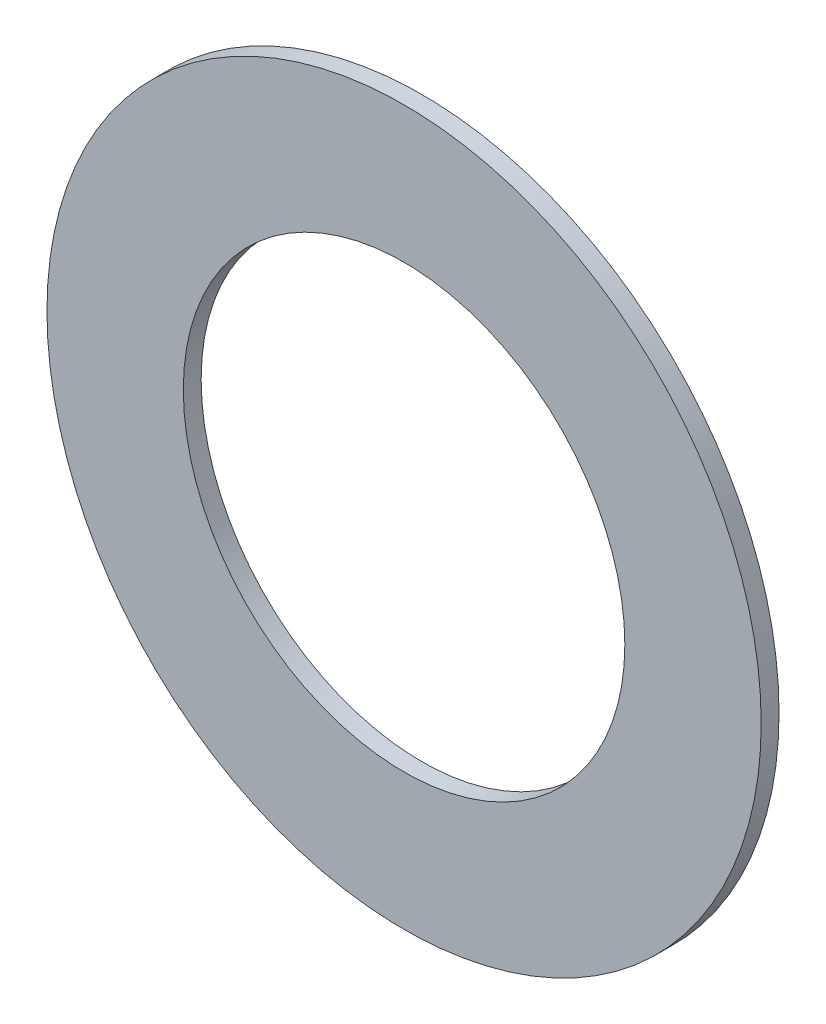
ISO-10303-21;
HEADER;
FILE_DESCRIPTION(('STEP AP214'),'2;1');
FILE_NAME('part.step','',(''),(''),'','','');
FILE_SCHEMA(('AUTOMOTIVE_DESIGN { 1 0 10303 214 1 1 1 1 }'));
ENDSEC;
DATA;
#1=APPLICATION_CONTEXT('core data for automotive mechanical design processes');
#2=APPLICATION_PROTOCOL_DEFINITION('international standard','automotive_design',2000,#1);
#3=PRODUCT_CONTEXT('',#1,'mechanical');
#4=PRODUCT('Part','Part','',(#3));
#5=PRODUCT_RELATED_PRODUCT_CATEGORY('part','',(#4));
#6=PRODUCT_DEFINITION_FORMATION('','',#4);
#7=PRODUCT_DEFINITION_CONTEXT('part definition',#1,'design');
#8=PRODUCT_DEFINITION('design','',#6,#7);
#9=PRODUCT_DEFINITION_SHAPE('','',#8);
#10=(LENGTH_UNIT() NAMED_UNIT(*) SI_UNIT(.MILLI.,.METRE.));
#11=(NAMED_UNIT(*) PLANE_ANGLE_UNIT() SI_UNIT($,.RADIAN.));
#12=(NAMED_UNIT(*) SI_UNIT($,.STERADIAN.) SOLID_ANGLE_UNIT());
#13=UNCERTAINTY_MEASURE_WITH_UNIT(LENGTH_MEASURE(1.E-05),#10,'distance_accuracy_value','');
#14=(GEOMETRIC_REPRESENTATION_CONTEXT(3) GLOBAL_UNCERTAINTY_ASSIGNED_CONTEXT((#13)) GLOBAL_UNIT_ASSIGNED_CONTEXT((#10,
#11,#12)) REPRESENTATION_CONTEXT('',''));
#15=CARTESIAN_POINT('',(0.,0.,0.));
#16=DIRECTION('',(0.,0.,1.));
#17=DIRECTION('',(1.,0.,0.));
#18=AXIS2_PLACEMENT_3D('',#15,#16,#17);
#19=CARTESIAN_POINT('',(0.,0.,3.175));
#20=DIRECTION('',(0.,0.,1.));
#21=DIRECTION('',(1.,0.,0.));
#22=AXIS2_PLACEMENT_3D('',#19,#20,#21);
#23=PLANE('',#22);
#24=CARTESIAN_POINT('',(0.,0.,3.175));
#25=DIRECTION('',(0.,0.,1.));
#26=DIRECTION('',(1.,0.,0.));
#27=AXIS2_PLACEMENT_3D('',#24,#25,#26);
#28=CIRCLE('',#27,63.5);
#29=CARTESIAN_POINT('',(63.5,0.,3.175));
#30=VERTEX_POINT('',#29);
#31=EDGE_CURVE('E10',#30,#30,#28,.T.);
#32=ORIENTED_EDGE('',*,*,#31,.T.);
#33=EDGE_LOOP('',(#32));
#34=FACE_BOUND('',#33,.T.);
#35=CARTESIAN_POINT('',(0.,0.,3.175));
#36=DIRECTION('',(0.,0.,1.));
#37=DIRECTION('',(1.,0.,0.));
#38=AXIS2_PLACEMENT_3D('',#35,#36,#37);
#39=CIRCLE('',#38,39.2557);
#40=CARTESIAN_POINT('',(39.2557,0.,3.175));
#41=VERTEX_POINT('',#40);
#42=EDGE_CURVE('E48',#41,#41,#39,.T.);
#43=ORIENTED_EDGE('',*,*,#42,.F.);
#44=EDGE_LOOP('',(#43));
#45=FACE_BOUND('',#44,.T.);
#46=ADVANCED_FACE('F37',(#34,#45),#23,.T.);
#47=CARTESIAN_POINT('',(0.,0.,0.));
#48=DIRECTION('',(0.,0.,1.));
#49=DIRECTION('',(1.,0.,0.));
#50=AXIS2_PLACEMENT_3D('',#47,#48,#49);
#51=PLANE('',#50);
#52=CARTESIAN_POINT('',(0.,0.,0.));
#53=DIRECTION('',(0.,0.,1.));
#54=DIRECTION('',(1.,0.,0.));
#55=AXIS2_PLACEMENT_3D('',#52,#53,#54);
#56=CIRCLE('',#55,63.5);
#57=CARTESIAN_POINT('',(63.5,0.,0.));
#58=VERTEX_POINT('',#57);
#59=EDGE_CURVE('E41',#58,#58,#56,.T.);
#60=ORIENTED_EDGE('',*,*,#59,.F.);
#61=EDGE_LOOP('',(#60));
#62=FACE_BOUND('',#61,.T.);
#63=CARTESIAN_POINT('',(0.,0.,0.));
#64=DIRECTION('',(0.,0.,1.));
#65=DIRECTION('',(1.,0.,0.));
#66=AXIS2_PLACEMENT_3D('',#63,#64,#65);
#67=CIRCLE('',#66,39.2557);
#68=CARTESIAN_POINT('',(39.2557,0.,0.));
#69=VERTEX_POINT('',#68);
#70=EDGE_CURVE('E50',#69,#69,#67,.T.);
#71=ORIENTED_EDGE('',*,*,#70,.T.);
#72=EDGE_LOOP('',(#71));
#73=FACE_BOUND('',#72,.T.);
#74=ADVANCED_FACE('F60',(#62,#73),#51,.F.);
#75=CARTESIAN_POINT('',(0.,0.,3.175));
#76=DIRECTION('',(0.,0.,-1.));
#77=DIRECTION('',(-1.,0.,0.));
#78=AXIS2_PLACEMENT_3D('',#75,#76,#77);
#79=CYLINDRICAL_SURFACE('',#78,63.5);
#80=ORIENTED_EDGE('',*,*,#31,.F.);
#81=EDGE_LOOP('',(#80));
#82=FACE_BOUND('',#81,.T.);
#83=ORIENTED_EDGE('',*,*,#59,.T.);
#84=EDGE_LOOP('',(#83));
#85=FACE_BOUND('',#84,.T.);
#86=ADVANCED_FACE('F39',(#82,#85),#79,.T.);
#87=CARTESIAN_POINT('',(0.,0.,3.175));
#88=DIRECTION('',(0.,0.,-1.));
#89=DIRECTION('',(-1.,0.,0.));
#90=AXIS2_PLACEMENT_3D('',#87,#88,#89);
#91=CYLINDRICAL_SURFACE('',#90,39.2557);
#92=ORIENTED_EDGE('',*,*,#42,.T.);
#93=EDGE_LOOP('',(#92));
#94=FACE_BOUND('',#93,.T.);
#95=ORIENTED_EDGE('',*,*,#70,.F.);
#96=EDGE_LOOP('',(#95));
#97=FACE_BOUND('',#96,.T.);
#98=ADVANCED_FACE('F56',(#94,#97),#91,.F.);
#99=CLOSED_SHELL('',(#46,#74,#86,#98));
#100=MANIFOLD_SOLID_BREP('B2',#99);
#101=ADVANCED_BREP_SHAPE_REPRESENTATION('',(#18,#100),#14);
#102=SHAPE_DEFINITION_REPRESENTATION(#9,#101);
ENDSEC;
END-ISO-10303-21;
